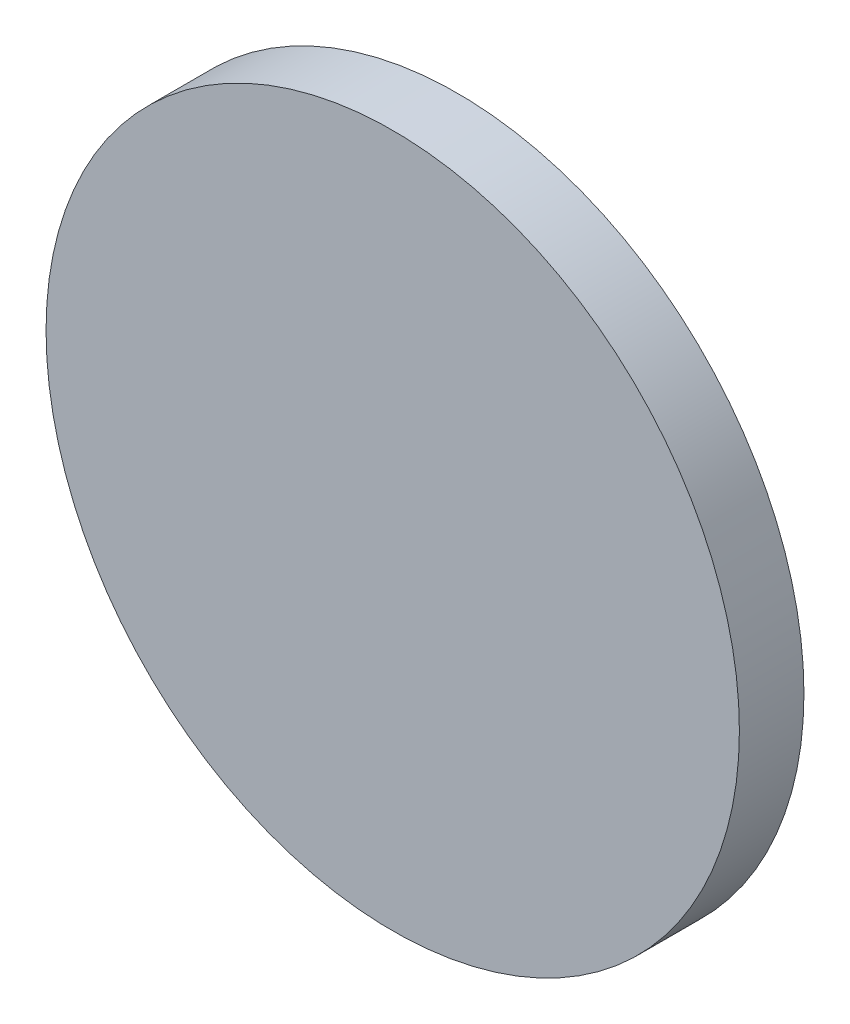
ISO-10303-21;
HEADER;
FILE_DESCRIPTION(('STEP AP214'),'2;1');
FILE_NAME('part.step','',(''),(''),'','','');
FILE_SCHEMA(('AUTOMOTIVE_DESIGN { 1 0 10303 214 1 1 1 1 }'));
ENDSEC;
DATA;
#1=APPLICATION_CONTEXT('core data for automotive mechanical design processes');
#2=APPLICATION_PROTOCOL_DEFINITION('international standard','automotive_design',2000,#1);
#3=PRODUCT_CONTEXT('',#1,'mechanical');
#4=PRODUCT('Part','Part','',(#3));
#5=PRODUCT_RELATED_PRODUCT_CATEGORY('part','',(#4));
#6=PRODUCT_DEFINITION_FORMATION('','',#4);
#7=PRODUCT_DEFINITION_CONTEXT('part definition',#1,'design');
#8=PRODUCT_DEFINITION('design','',#6,#7);
#9=PRODUCT_DEFINITION_SHAPE('','',#8);
#10=(LENGTH_UNIT() NAMED_UNIT(*) SI_UNIT(.MILLI.,.METRE.));
#11=(NAMED_UNIT(*) PLANE_ANGLE_UNIT() SI_UNIT($,.RADIAN.));
#12=(NAMED_UNIT(*) SI_UNIT($,.STERADIAN.) SOLID_ANGLE_UNIT());
#13=UNCERTAINTY_MEASURE_WITH_UNIT(LENGTH_MEASURE(1.E-05),#10,'distance_accuracy_value','');
#14=(GEOMETRIC_REPRESENTATION_CONTEXT(3) GLOBAL_UNCERTAINTY_ASSIGNED_CONTEXT((#13)) GLOBAL_UNIT_ASSIGNED_CONTEXT((#10,
#11,#12)) REPRESENTATION_CONTEXT('',''));
#15=CARTESIAN_POINT('',(0.,0.,0.));
#16=DIRECTION('',(0.,0.,1.));
#17=DIRECTION('',(1.,0.,0.));
#18=AXIS2_PLACEMENT_3D('',#15,#16,#17);
#19=CARTESIAN_POINT('',(-70.2258864779424,36.796064435805,1.75));
#20=DIRECTION('',(0.,0.,-1.));
#21=DIRECTION('',(-1.,0.,0.));
#22=AXIS2_PLACEMENT_3D('',#19,#20,#21);
#23=CYLINDRICAL_SURFACE('',#22,9.4);
#24=CARTESIAN_POINT('',(-70.2258864779424,36.796064435805,1.75));
#25=DIRECTION('',(0.,0.,1.));
#26=DIRECTION('',(1.,0.,0.));
#27=AXIS2_PLACEMENT_3D('',#24,#25,#26);
#28=CIRCLE('',#27,9.4);
#29=CARTESIAN_POINT('',(-60.8258864779424,36.796064435805,1.75));
#30=VERTEX_POINT('',#29);
#31=EDGE_CURVE('E10',#30,#30,#28,.T.);
#32=ORIENTED_EDGE('',*,*,#31,.F.);
#33=EDGE_LOOP('',(#32));
#34=FACE_BOUND('',#33,.T.);
#35=CARTESIAN_POINT('',(-70.2258864779424,36.796064435805,0.));
#36=DIRECTION('',(0.,0.,1.));
#37=DIRECTION('',(1.,0.,0.));
#38=AXIS2_PLACEMENT_3D('',#35,#36,#37);
#39=CIRCLE('',#38,9.4);
#40=CARTESIAN_POINT('',(-60.8258864779424,36.796064435805,0.));
#41=VERTEX_POINT('',#40);
#42=EDGE_CURVE('E34',#41,#41,#39,.T.);
#43=ORIENTED_EDGE('',*,*,#42,.T.);
#44=EDGE_LOOP('',(#43));
#45=FACE_BOUND('',#44,.T.);
#46=ADVANCED_FACE('F31',(#34,#45),#23,.T.);
#47=CARTESIAN_POINT('',(-70.2258864779424,36.796064435805,1.75));
#48=DIRECTION('',(0.,0.,1.));
#49=DIRECTION('',(1.,0.,0.));
#50=AXIS2_PLACEMENT_3D('',#47,#48,#49);
#51=PLANE('',#50);
#52=ORIENTED_EDGE('',*,*,#31,.T.);
#53=EDGE_LOOP('',(#52));
#54=FACE_BOUND('',#53,.T.);
#55=ADVANCED_FACE('F46',(#54),#51,.T.);
#56=CARTESIAN_POINT('',(-70.2258864779424,36.796064435805,0.));
#57=DIRECTION('',(0.,0.,1.));
#58=DIRECTION('',(1.,0.,0.));
#59=AXIS2_PLACEMENT_3D('',#56,#57,#58);
#60=PLANE('',#59);
#61=ORIENTED_EDGE('',*,*,#42,.F.);
#62=EDGE_LOOP('',(#61));
#63=FACE_BOUND('',#62,.T.);
#64=ADVANCED_FACE('F44',(#63),#60,.F.);
#65=CLOSED_SHELL('',(#46,#55,#64));
#66=MANIFOLD_SOLID_BREP('B2',#65);
#67=ADVANCED_BREP_SHAPE_REPRESENTATION('',(#18,#66),#14);
#68=SHAPE_DEFINITION_REPRESENTATION(#9,#67);
ENDSEC;
END-ISO-10303-21;
